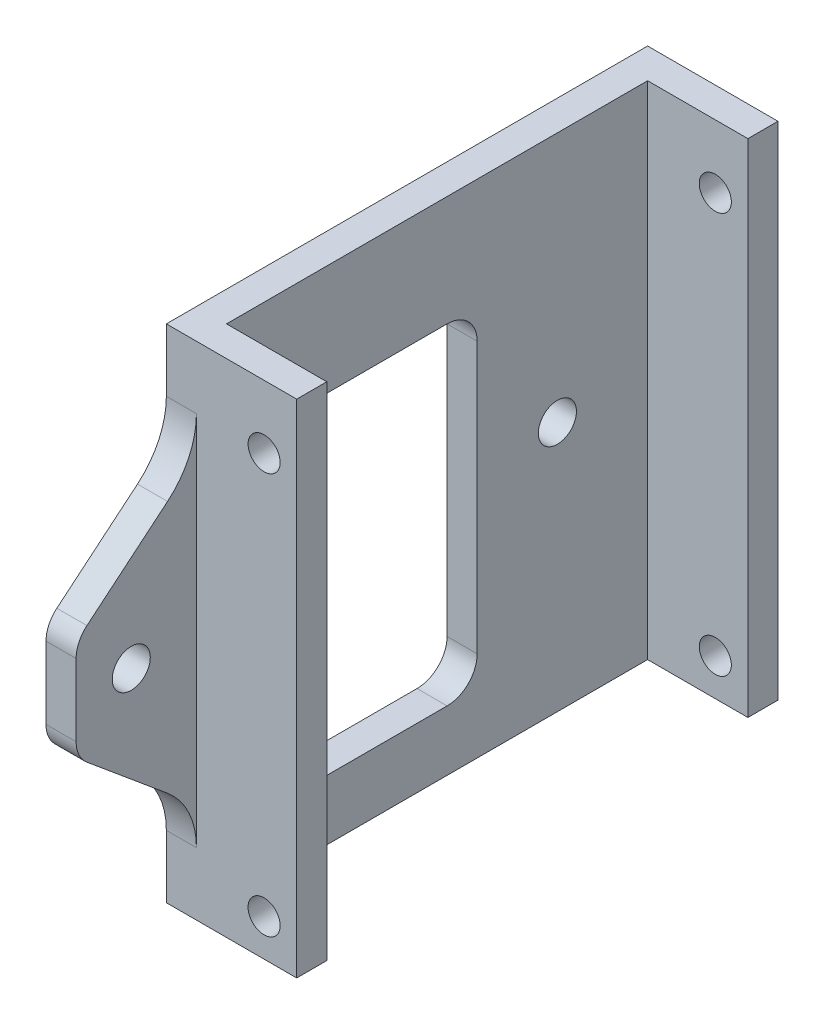
ISO-10303-21;
HEADER;
FILE_DESCRIPTION(('STEP AP214'),'2;1');
FILE_NAME('part.step','',(''),(''),'','','');
FILE_SCHEMA(('AUTOMOTIVE_DESIGN { 1 0 10303 214 1 1 1 1 }'));
ENDSEC;
DATA;
#1=APPLICATION_CONTEXT('core data for automotive mechanical design processes');
#2=APPLICATION_PROTOCOL_DEFINITION('international standard','automotive_design',2000,#1);
#3=PRODUCT_CONTEXT('',#1,'mechanical');
#4=PRODUCT('Part','Part','',(#3));
#5=PRODUCT_RELATED_PRODUCT_CATEGORY('part','',(#4));
#6=PRODUCT_DEFINITION_FORMATION('','',#4);
#7=PRODUCT_DEFINITION_CONTEXT('part definition',#1,'design');
#8=PRODUCT_DEFINITION('design','',#6,#7);
#9=PRODUCT_DEFINITION_SHAPE('','',#8);
#10=(LENGTH_UNIT() NAMED_UNIT(*) SI_UNIT(.MILLI.,.METRE.));
#11=(NAMED_UNIT(*) PLANE_ANGLE_UNIT() SI_UNIT($,.RADIAN.));
#12=(NAMED_UNIT(*) SI_UNIT($,.STERADIAN.) SOLID_ANGLE_UNIT());
#13=UNCERTAINTY_MEASURE_WITH_UNIT(LENGTH_MEASURE(1.E-05),#10,'distance_accuracy_value','');
#14=(GEOMETRIC_REPRESENTATION_CONTEXT(3) GLOBAL_UNCERTAINTY_ASSIGNED_CONTEXT((#13)) GLOBAL_UNIT_ASSIGNED_CONTEXT((#10,
#11,#12)) REPRESENTATION_CONTEXT('',''));
#15=CARTESIAN_POINT('',(0.,0.,0.));
#16=DIRECTION('',(0.,0.,1.));
#17=DIRECTION('',(1.,0.,0.));
#18=AXIS2_PLACEMENT_3D('',#15,#16,#17);
#19=CARTESIAN_POINT('',(0.,50.,12.));
#20=DIRECTION('',(0.,0.,-1.));
#21=DIRECTION('',(-1.,0.,0.));
#22=AXIS2_PLACEMENT_3D('',#19,#20,#21);
#23=PLANE('',#22);
#24=DIRECTION('',(0.,-1.,0.));
#25=VECTOR('',#24,1.);
#26=CARTESIAN_POINT('',(0.,50.,12.));
#27=LINE('',#26,#25);
#28=CARTESIAN_POINT('',(0.,28.5948751620467,12.));
#29=VERTEX_POINT('',#28);
#30=CARTESIAN_POINT('',(0.,21.4051248379533,12.));
#31=VERTEX_POINT('',#30);
#32=EDGE_CURVE('E226',#29,#31,#27,.T.);
#33=ORIENTED_EDGE('',*,*,#32,.T.);
#34=DIRECTION('',(1.,0.,0.));
#35=VECTOR('',#34,1.);
#36=CARTESIAN_POINT('',(0.,21.4051248379533,12.));
#37=LINE('',#36,#35);
#38=CARTESIAN_POINT('',(3.00000000000001,21.4051248379533,12.));
#39=VERTEX_POINT('',#38);
#40=EDGE_CURVE('E237',#31,#39,#37,.T.);
#41=ORIENTED_EDGE('',*,*,#40,.T.);
#42=DIRECTION('',(0.,-1.,0.));
#43=VECTOR('',#42,1.);
#44=CARTESIAN_POINT('',(3.00000000000001,50.,12.));
#45=LINE('',#44,#43);
#46=CARTESIAN_POINT('',(3.00000000000001,28.5948751620467,12.));
#47=VERTEX_POINT('',#46);
#48=EDGE_CURVE('E223',#47,#39,#45,.T.);
#49=ORIENTED_EDGE('',*,*,#48,.F.);
#50=DIRECTION('',(1.,0.,0.));
#51=VECTOR('',#50,1.);
#52=CARTESIAN_POINT('',(0.,28.5948751620467,12.));
#53=LINE('',#52,#51);
#54=EDGE_CURVE('E235',#47,#29,#53,.F.);
#55=ORIENTED_EDGE('',*,*,#54,.T.);
#56=EDGE_LOOP('',(#33,#41,#49,#55));
#57=FACE_BOUND('',#56,.T.);
#58=ADVANCED_FACE('F34',(#57),#23,.F.);
#59=CARTESIAN_POINT('',(3.00000000000001,50.,12.));
#60=DIRECTION('',(-1.,0.,0.));
#61=DIRECTION('',(0.,0.,1.));
#62=AXIS2_PLACEMENT_3D('',#59,#60,#61);
#63=PLANE('',#62);
#64=CARTESIAN_POINT('',(3.00000000000001,25.,6.5));
#65=DIRECTION('',(1.,0.,0.));
#66=DIRECTION('',(0.,0.,-1.));
#67=AXIS2_PLACEMENT_3D('',#64,#65,#66);
#68=CIRCLE('',#67,1.89865);
#69=CARTESIAN_POINT('',(3.00000000000001,25.,4.60135000000001));
#70=VERTEX_POINT('',#69);
#71=EDGE_CURVE('E518',#70,#70,#68,.T.);
#72=ORIENTED_EDGE('',*,*,#71,.F.);
#73=EDGE_LOOP('',(#72));
#74=FACE_BOUND('',#73,.T.);
#75=ORIENTED_EDGE('',*,*,#48,.T.);
#76=CARTESIAN_POINT('',(3.00000000000001,21.4051248379533,9.));
#77=DIRECTION('',(-1.,0.,0.));
#78=DIRECTION('',(0.,0.,1.));
#79=AXIS2_PLACEMENT_3D('',#76,#77,#78);
#80=CIRCLE('',#79,3.);
#81=CARTESIAN_POINT('',(3.00000000000001,19.1004609991612,10.9205531989934));
#82=VERTEX_POINT('',#81);
#83=EDGE_CURVE('E242',#39,#82,#80,.F.);
#84=ORIENTED_EDGE('',*,*,#83,.T.);
#85=DIRECTION('',(0.,0.64018439966448,0.768221279597376));
#86=VECTOR('',#85,1.);
#87=CARTESIAN_POINT('',(3.00000000000001,12.3987706689035,2.87852480268419));
#88=LINE('',#87,#86);
#89=CARTESIAN_POINT('',(3.00000000000001,12.3987706689035,2.8785248026842));
#90=VERTEX_POINT('',#89);
#91=EDGE_CURVE('E216',#90,#82,#88,.T.);
#92=ORIENTED_EDGE('',*,*,#91,.F.);
#93=CARTESIAN_POINT('',(3.00000000000001,6.25300043212446,8.00000000000001));
#94=DIRECTION('',(1.,0.,0.));
#95=DIRECTION('',(0.,0.,-1.));
#96=AXIS2_PLACEMENT_3D('',#93,#94,#95);
#97=CIRCLE('',#96,8.);
#98=CARTESIAN_POINT('',(3.00000000000001,6.25300043212443,0.));
#99=VERTEX_POINT('',#98);
#100=EDGE_CURVE('E198',#99,#90,#97,.T.);
#101=ORIENTED_EDGE('',*,*,#100,.F.);
#102=DIRECTION('',(0.,-1.,0.));
#103=VECTOR('',#102,1.);
#104=CARTESIAN_POINT('',(3.00000000000001,50.,0.));
#105=LINE('',#104,#103);
#106=CARTESIAN_POINT('',(3.00000000000001,43.7469995678756,0.));
#107=VERTEX_POINT('',#106);
#108=EDGE_CURVE('E214',#107,#99,#105,.T.);
#109=ORIENTED_EDGE('',*,*,#108,.F.);
#110=CARTESIAN_POINT('',(3.00000000000001,43.7469995678755,8.));
#111=DIRECTION('',(-1.,0.,0.));
#112=DIRECTION('',(0.,0.,1.));
#113=AXIS2_PLACEMENT_3D('',#110,#111,#112);
#114=CIRCLE('',#113,8.);
#115=CARTESIAN_POINT('',(3.00000000000001,37.6012293310965,2.87852480268419));
#116=VERTEX_POINT('',#115);
#117=EDGE_CURVE('E321',#107,#116,#114,.T.);
#118=ORIENTED_EDGE('',*,*,#117,.T.);
#119=DIRECTION('',(0.,-0.640184399664479,0.768221279597376));
#120=VECTOR('',#119,1.);
#121=CARTESIAN_POINT('',(3.00000000000001,37.6012293310965,2.87852480268419));
#122=LINE('',#121,#120);
#123=CARTESIAN_POINT('',(3.00000000000001,30.8995390008388,10.9205531989934));
#124=VERTEX_POINT('',#123);
#125=EDGE_CURVE('E316',#116,#124,#122,.T.);
#126=ORIENTED_EDGE('',*,*,#125,.T.);
#127=CARTESIAN_POINT('',(3.00000000000001,28.5948751620467,9.));
#128=DIRECTION('',(-1.,0.,0.));
#129=DIRECTION('',(0.,0.,1.));
#130=AXIS2_PLACEMENT_3D('',#127,#128,#129);
#131=CIRCLE('',#130,3.);
#132=EDGE_CURVE('E240',#124,#47,#131,.F.);
#133=ORIENTED_EDGE('',*,*,#132,.T.);
#134=EDGE_LOOP('',(#75,#84,#92,#101,#109,#118,#126,#133));
#135=FACE_BOUND('',#134,.T.);
#136=ADVANCED_FACE('F212',(#74,#135),#63,.F.);
#137=CARTESIAN_POINT('',(3.,50.,-45.));
#138=DIRECTION('',(-1.,0.,0.));
#139=DIRECTION('',(0.,0.,1.));
#140=AXIS2_PLACEMENT_3D('',#137,#138,#139);
#141=PLANE('',#140);
#142=CARTESIAN_POINT('',(3.00000000000001,25.,-36.));
#143=DIRECTION('',(1.,0.,0.));
#144=DIRECTION('',(0.,0.,-1.));
#145=AXIS2_PLACEMENT_3D('',#142,#143,#144);
#146=CIRCLE('',#145,1.89865);
#147=CARTESIAN_POINT('',(3.00000000000001,25.,-37.89865));
#148=VERTEX_POINT('',#147);
#149=EDGE_CURVE('E512',#148,#148,#146,.T.);
#150=ORIENTED_EDGE('',*,*,#149,.F.);
#151=EDGE_LOOP('',(#150));
#152=FACE_BOUND('',#151,.T.);
#153=DIRECTION('',(0.,0.,-1.));
#154=VECTOR('',#153,1.);
#155=CARTESIAN_POINT('',(3.,0.,-45.));
#156=LINE('',#155,#154);
#157=CARTESIAN_POINT('',(3.00000000000001,0.,-3.));
#158=VERTEX_POINT('',#157);
#159=CARTESIAN_POINT('',(3.,0.,-45.));
#160=VERTEX_POINT('',#159);
#161=EDGE_CURVE('E378',#158,#160,#156,.T.);
#162=ORIENTED_EDGE('',*,*,#161,.T.);
#163=DIRECTION('',(0.,-1.,0.));
#164=VECTOR('',#163,1.);
#165=CARTESIAN_POINT('',(3.,50.,-45.));
#166=LINE('',#165,#164);
#167=CARTESIAN_POINT('',(3.,50.,-45.));
#168=VERTEX_POINT('',#167);
#169=EDGE_CURVE('E397',#168,#160,#166,.T.);
#170=ORIENTED_EDGE('',*,*,#169,.F.);
#171=DIRECTION('',(0.,0.,-1.));
#172=VECTOR('',#171,1.);
#173=CARTESIAN_POINT('',(3.,50.,-45.));
#174=LINE('',#173,#172);
#175=CARTESIAN_POINT('',(3.00000000000001,50.,-3.));
#176=VERTEX_POINT('',#175);
#177=EDGE_CURVE('E364',#176,#168,#174,.T.);
#178=ORIENTED_EDGE('',*,*,#177,.F.);
#179=DIRECTION('',(0.,-1.,0.));
#180=VECTOR('',#179,1.);
#181=CARTESIAN_POINT('',(3.00000000000001,50.,-3.));
#182=LINE('',#181,#180);
#183=EDGE_CURVE('E400',#176,#158,#182,.T.);
#184=ORIENTED_EDGE('',*,*,#183,.T.);
#185=EDGE_LOOP('',(#162,#170,#178,#184));
#186=FACE_BOUND('',#185,.T.);
#187=DIRECTION('',(0.,-1.,0.));
#188=VECTOR('',#187,1.);
#189=CARTESIAN_POINT('',(3.00000000000001,39.,-28.));
#190=LINE('',#189,#188);
#191=CARTESIAN_POINT('',(3.00000000000001,36.,-28.));
#192=VERTEX_POINT('',#191);
#193=CARTESIAN_POINT('',(3.00000000000001,9.,-28.));
#194=VERTEX_POINT('',#193);
#195=EDGE_CURVE('E288',#192,#194,#190,.T.);
#196=ORIENTED_EDGE('',*,*,#195,.T.);
#197=CARTESIAN_POINT('',(3.00000000000001,9.,-25.));
#198=DIRECTION('',(-1.,0.,0.));
#199=DIRECTION('',(0.,0.,1.));
#200=AXIS2_PLACEMENT_3D('',#197,#198,#199);
#201=CIRCLE('',#200,3.);
#202=CARTESIAN_POINT('',(3.00000000000001,6.,-25.));
#203=VERTEX_POINT('',#202);
#204=EDGE_CURVE('E276',#194,#203,#201,.T.);
#205=ORIENTED_EDGE('',*,*,#204,.T.);
#206=DIRECTION('',(0.,0.,1.));
#207=VECTOR('',#206,1.);
#208=CARTESIAN_POINT('',(3.00000000000001,6.,-28.));
#209=LINE('',#208,#207);
#210=CARTESIAN_POINT('',(3.00000000000001,6.,-7.6));
#211=VERTEX_POINT('',#210);
#212=EDGE_CURVE('E501',#203,#211,#209,.T.);
#213=ORIENTED_EDGE('',*,*,#212,.T.);
#214=CARTESIAN_POINT('',(3.00000000000001,9.,-7.6));
#215=DIRECTION('',(-1.,0.,0.));
#216=DIRECTION('',(0.,0.,1.));
#217=AXIS2_PLACEMENT_3D('',#214,#215,#216);
#218=CIRCLE('',#217,3.);
#219=CARTESIAN_POINT('',(3.00000000000001,9.,-4.6));
#220=VERTEX_POINT('',#219);
#221=EDGE_CURVE('E272',#211,#220,#218,.T.);
#222=ORIENTED_EDGE('',*,*,#221,.T.);
#223=DIRECTION('',(0.,-1.,0.));
#224=VECTOR('',#223,1.);
#225=CARTESIAN_POINT('',(3.00000000000001,39.,-4.6));
#226=LINE('',#225,#224);
#227=CARTESIAN_POINT('',(3.00000000000001,36.,-4.6));
#228=VERTEX_POINT('',#227);
#229=EDGE_CURVE('E493',#228,#220,#226,.T.);
#230=ORIENTED_EDGE('',*,*,#229,.F.);
#231=CARTESIAN_POINT('',(3.00000000000001,36.,-7.6));
#232=DIRECTION('',(-1.,0.,0.));
#233=DIRECTION('',(0.,0.,1.));
#234=AXIS2_PLACEMENT_3D('',#231,#232,#233);
#235=CIRCLE('',#234,3.);
#236=CARTESIAN_POINT('',(3.00000000000001,39.,-7.6));
#237=VERTEX_POINT('',#236);
#238=EDGE_CURVE('E280',#228,#237,#235,.T.);
#239=ORIENTED_EDGE('',*,*,#238,.T.);
#240=DIRECTION('',(0.,0.,1.));
#241=VECTOR('',#240,1.);
#242=CARTESIAN_POINT('',(3.00000000000001,39.,-28.));
#243=LINE('',#242,#241);
#244=CARTESIAN_POINT('',(3.00000000000001,39.,-25.));
#245=VERTEX_POINT('',#244);
#246=EDGE_CURVE('E289',#245,#237,#243,.T.);
#247=ORIENTED_EDGE('',*,*,#246,.F.);
#248=CARTESIAN_POINT('',(3.00000000000001,36.,-25.));
#249=DIRECTION('',(-1.,0.,0.));
#250=DIRECTION('',(0.,0.,1.));
#251=AXIS2_PLACEMENT_3D('',#248,#249,#250);
#252=CIRCLE('',#251,3.);
#253=EDGE_CURVE('E42',#245,#192,#252,.T.);
#254=ORIENTED_EDGE('',*,*,#253,.T.);
#255=EDGE_LOOP('',(#196,#205,#213,#222,#230,#239,#247,#254));
#256=FACE_BOUND('',#255,.T.);
#257=ADVANCED_FACE('F287',(#152,#186,#256),#141,.F.);
#258=CARTESIAN_POINT('',(0.,50.,0.));
#259=DIRECTION('',(1.,0.,0.));
#260=DIRECTION('',(0.,0.,-1.));
#261=AXIS2_PLACEMENT_3D('',#258,#259,#260);
#262=PLANE('',#261);
#263=CARTESIAN_POINT('',(0.,25.,6.5));
#264=DIRECTION('',(1.,0.,0.));
#265=DIRECTION('',(0.,0.,-1.));
#266=AXIS2_PLACEMENT_3D('',#263,#264,#265);
#267=CIRCLE('',#266,1.89865);
#268=CARTESIAN_POINT('',(0.,25.,4.60135000000001));
#269=VERTEX_POINT('',#268);
#270=EDGE_CURVE('E515',#269,#269,#267,.T.);
#271=ORIENTED_EDGE('',*,*,#270,.T.);
#272=EDGE_LOOP('',(#271));
#273=FACE_BOUND('',#272,.T.);
#274=CARTESIAN_POINT('',(0.,25.,-36.));
#275=DIRECTION('',(1.,0.,0.));
#276=DIRECTION('',(0.,0.,-1.));
#277=AXIS2_PLACEMENT_3D('',#274,#275,#276);
#278=CIRCLE('',#277,1.89865);
#279=CARTESIAN_POINT('',(0.,25.,-37.89865));
#280=VERTEX_POINT('',#279);
#281=EDGE_CURVE('E307',#280,#280,#278,.T.);
#282=ORIENTED_EDGE('',*,*,#281,.T.);
#283=EDGE_LOOP('',(#282));
#284=FACE_BOUND('',#283,.T.);
#285=DIRECTION('',(0.,0.64018439966448,0.768221279597376));
#286=VECTOR('',#285,1.);
#287=CARTESIAN_POINT('',(0.,12.3987706689035,2.87852480268419));
#288=LINE('',#287,#286);
#289=CARTESIAN_POINT('',(0.,12.3987706689035,2.8785248026842));
#290=VERTEX_POINT('',#289);
#291=CARTESIAN_POINT('',(0.,19.1004609991612,10.9205531989934));
#292=VERTEX_POINT('',#291);
#293=EDGE_CURVE('E217',#290,#292,#288,.T.);
#294=ORIENTED_EDGE('',*,*,#293,.T.);
#295=CARTESIAN_POINT('',(0.,21.4051248379533,9.));
#296=DIRECTION('',(1.,0.,0.));
#297=DIRECTION('',(0.,0.,-1.));
#298=AXIS2_PLACEMENT_3D('',#295,#296,#297);
#299=CIRCLE('',#298,3.);
#300=EDGE_CURVE('E248',#292,#31,#299,.F.);
#301=ORIENTED_EDGE('',*,*,#300,.T.);
#302=ORIENTED_EDGE('',*,*,#32,.F.);
#303=CARTESIAN_POINT('',(0.,28.5948751620467,9.));
#304=DIRECTION('',(1.,0.,0.));
#305=DIRECTION('',(0.,0.,-1.));
#306=AXIS2_PLACEMENT_3D('',#303,#304,#305);
#307=CIRCLE('',#306,3.);
#308=CARTESIAN_POINT('',(0.,30.8995390008388,10.9205531989934));
#309=VERTEX_POINT('',#308);
#310=EDGE_CURVE('E246',#29,#309,#307,.F.);
#311=ORIENTED_EDGE('',*,*,#310,.T.);
#312=DIRECTION('',(0.,-0.640184399664479,0.768221279597376));
#313=VECTOR('',#312,1.);
#314=CARTESIAN_POINT('',(0.,37.6012293310965,2.87852480268419));
#315=LINE('',#314,#313);
#316=CARTESIAN_POINT('',(0.,37.6012293310965,2.87852480268419));
#317=VERTEX_POINT('',#316);
#318=EDGE_CURVE('E315',#317,#309,#315,.T.);
#319=ORIENTED_EDGE('',*,*,#318,.F.);
#320=CARTESIAN_POINT('',(0.,43.7469995678755,8.));
#321=DIRECTION('',(-1.,0.,0.));
#322=DIRECTION('',(0.,0.,1.));
#323=AXIS2_PLACEMENT_3D('',#320,#321,#322);
#324=CIRCLE('',#323,8.);
#325=CARTESIAN_POINT('',(0.,43.7469995678756,0.));
#326=VERTEX_POINT('',#325);
#327=EDGE_CURVE('E313',#326,#317,#324,.T.);
#328=ORIENTED_EDGE('',*,*,#327,.F.);
#329=DIRECTION('',(0.,-1.,0.));
#330=VECTOR('',#329,1.);
#331=CARTESIAN_POINT('',(0.,50.,0.));
#332=LINE('',#331,#330);
#333=CARTESIAN_POINT('',(0.,50.,0.));
#334=VERTEX_POINT('',#333);
#335=EDGE_CURVE('E319',#334,#326,#332,.T.);
#336=ORIENTED_EDGE('',*,*,#335,.F.);
#337=DIRECTION('',(0.,0.,1.));
#338=VECTOR('',#337,1.);
#339=CARTESIAN_POINT('',(0.,50.,0.));
#340=LINE('',#339,#338);
#341=CARTESIAN_POINT('',(0.,50.,-48.));
#342=VERTEX_POINT('',#341);
#343=EDGE_CURVE('E354',#342,#334,#340,.T.);
#344=ORIENTED_EDGE('',*,*,#343,.F.);
#345=DIRECTION('',(0.,-1.,0.));
#346=VECTOR('',#345,1.);
#347=CARTESIAN_POINT('',(0.,50.,-48.));
#348=LINE('',#347,#346);
#349=CARTESIAN_POINT('',(0.,0.,-48.));
#350=VERTEX_POINT('',#349);
#351=EDGE_CURVE('E372',#342,#350,#348,.T.);
#352=ORIENTED_EDGE('',*,*,#351,.T.);
#353=DIRECTION('',(0.,0.,1.));
#354=VECTOR('',#353,1.);
#355=CARTESIAN_POINT('',(0.,0.,0.));
#356=LINE('',#355,#354);
#357=CARTESIAN_POINT('',(0.,0.,0.));
#358=VERTEX_POINT('',#357);
#359=EDGE_CURVE('E358',#350,#358,#356,.T.);
#360=ORIENTED_EDGE('',*,*,#359,.T.);
#361=DIRECTION('',(0.,1.,0.));
#362=VECTOR('',#361,1.);
#363=CARTESIAN_POINT('',(0.,0.,0.));
#364=LINE('',#363,#362);
#365=CARTESIAN_POINT('',(0.,6.25300043212443,0.));
#366=VERTEX_POINT('',#365);
#367=EDGE_CURVE('E206',#358,#366,#364,.T.);
#368=ORIENTED_EDGE('',*,*,#367,.T.);
#369=CARTESIAN_POINT('',(0.,6.25300043212446,8.00000000000001));
#370=DIRECTION('',(1.,0.,0.));
#371=DIRECTION('',(0.,0.,-1.));
#372=AXIS2_PLACEMENT_3D('',#369,#370,#371);
#373=CIRCLE('',#372,8.);
#374=EDGE_CURVE('E201',#366,#290,#373,.T.);
#375=ORIENTED_EDGE('',*,*,#374,.T.);
#376=EDGE_LOOP('',(#294,#301,#302,#311,#319,#328,#336,#344,#352,#360,#368,#375));
#377=FACE_BOUND('',#376,.T.);
#378=DIRECTION('',(0.,0.,1.));
#379=VECTOR('',#378,1.);
#380=CARTESIAN_POINT('',(0.,6.,-28.));
#381=LINE('',#380,#379);
#382=CARTESIAN_POINT('',(0.,6.,-25.));
#383=VERTEX_POINT('',#382);
#384=CARTESIAN_POINT('',(0.,6.,-7.6));
#385=VERTEX_POINT('',#384);
#386=EDGE_CURVE('E297',#383,#385,#381,.T.);
#387=ORIENTED_EDGE('',*,*,#386,.F.);
#388=CARTESIAN_POINT('',(0.,9.,-25.));
#389=DIRECTION('',(1.,0.,0.));
#390=DIRECTION('',(0.,0.,-1.));
#391=AXIS2_PLACEMENT_3D('',#388,#389,#390);
#392=CIRCLE('',#391,3.);
#393=CARTESIAN_POINT('',(0.,9.,-28.));
#394=VERTEX_POINT('',#393);
#395=EDGE_CURVE('E278',#383,#394,#392,.T.);
#396=ORIENTED_EDGE('',*,*,#395,.T.);
#397=DIRECTION('',(0.,-1.,0.));
#398=VECTOR('',#397,1.);
#399=CARTESIAN_POINT('',(0.,39.,-28.));
#400=LINE('',#399,#398);
#401=CARTESIAN_POINT('',(0.,36.,-28.));
#402=VERTEX_POINT('',#401);
#403=EDGE_CURVE('E303',#402,#394,#400,.T.);
#404=ORIENTED_EDGE('',*,*,#403,.F.);
#405=CARTESIAN_POINT('',(0.,36.,-25.));
#406=DIRECTION('',(1.,0.,0.));
#407=DIRECTION('',(0.,0.,-1.));
#408=AXIS2_PLACEMENT_3D('',#405,#406,#407);
#409=CIRCLE('',#408,3.);
#410=CARTESIAN_POINT('',(0.,39.,-25.));
#411=VERTEX_POINT('',#410);
#412=EDGE_CURVE('E11',#402,#411,#409,.T.);
#413=ORIENTED_EDGE('',*,*,#412,.T.);
#414=DIRECTION('',(0.,0.,1.));
#415=VECTOR('',#414,1.);
#416=CARTESIAN_POINT('',(0.,39.,-28.));
#417=LINE('',#416,#415);
#418=CARTESIAN_POINT('',(0.,39.,-7.6));
#419=VERTEX_POINT('',#418);
#420=EDGE_CURVE('E300',#411,#419,#417,.T.);
#421=ORIENTED_EDGE('',*,*,#420,.T.);
#422=CARTESIAN_POINT('',(0.,36.,-7.6));
#423=DIRECTION('',(1.,0.,0.));
#424=DIRECTION('',(0.,0.,-1.));
#425=AXIS2_PLACEMENT_3D('',#422,#423,#424);
#426=CIRCLE('',#425,3.);
#427=CARTESIAN_POINT('',(0.,36.,-4.6));
#428=VERTEX_POINT('',#427);
#429=EDGE_CURVE('E282',#419,#428,#426,.T.);
#430=ORIENTED_EDGE('',*,*,#429,.T.);
#431=DIRECTION('',(0.,-1.,0.));
#432=VECTOR('',#431,1.);
#433=CARTESIAN_POINT('',(0.,39.,-4.6));
#434=LINE('',#433,#432);
#435=CARTESIAN_POINT('',(0.,9.,-4.6));
#436=VERTEX_POINT('',#435);
#437=EDGE_CURVE('E302',#428,#436,#434,.T.);
#438=ORIENTED_EDGE('',*,*,#437,.T.);
#439=CARTESIAN_POINT('',(0.,9.,-7.6));
#440=DIRECTION('',(1.,0.,0.));
#441=DIRECTION('',(0.,0.,-1.));
#442=AXIS2_PLACEMENT_3D('',#439,#440,#441);
#443=CIRCLE('',#442,3.);
#444=EDGE_CURVE('E274',#436,#385,#443,.T.);
#445=ORIENTED_EDGE('',*,*,#444,.T.);
#446=EDGE_LOOP('',(#387,#396,#404,#413,#421,#430,#438,#445));
#447=FACE_BOUND('',#446,.T.);
#448=ADVANCED_FACE('F434',(#273,#284,#377,#447),#262,.F.);
#449=CARTESIAN_POINT('',(0.,50.,0.));
#450=DIRECTION('',(0.,1.,0.));
#451=DIRECTION('',(0.,0.,1.));
#452=AXIS2_PLACEMENT_3D('',#449,#450,#451);
#453=PLANE('',#452);
#454=ORIENTED_EDGE('',*,*,#343,.T.);
#455=DIRECTION('',(1.,0.,0.));
#456=VECTOR('',#455,1.);
#457=CARTESIAN_POINT('',(3.00000000000001,50.,0.));
#458=LINE('',#457,#456);
#459=CARTESIAN_POINT('',(13.,50.,0.));
#460=VERTEX_POINT('',#459);
#461=EDGE_CURVE('E357',#334,#460,#458,.T.);
#462=ORIENTED_EDGE('',*,*,#461,.T.);
#463=DIRECTION('',(0.,0.,-1.));
#464=VECTOR('',#463,1.);
#465=CARTESIAN_POINT('',(13.,50.,-3.00000000000001));
#466=LINE('',#465,#464);
#467=CARTESIAN_POINT('',(13.,50.,-3.00000000000001));
#468=VERTEX_POINT('',#467);
#469=EDGE_CURVE('E360',#460,#468,#466,.T.);
#470=ORIENTED_EDGE('',*,*,#469,.T.);
#471=DIRECTION('',(-1.,0.,0.));
#472=VECTOR('',#471,1.);
#473=CARTESIAN_POINT('',(3.00000000000001,50.,-3.));
#474=LINE('',#473,#472);
#475=EDGE_CURVE('E362',#468,#176,#474,.T.);
#476=ORIENTED_EDGE('',*,*,#475,.T.);
#477=ORIENTED_EDGE('',*,*,#177,.T.);
#478=DIRECTION('',(1.,0.,0.));
#479=VECTOR('',#478,1.);
#480=CARTESIAN_POINT('',(13.,50.,-45.));
#481=LINE('',#480,#479);
#482=CARTESIAN_POINT('',(13.,50.,-45.));
#483=VERTEX_POINT('',#482);
#484=EDGE_CURVE('E366',#168,#483,#481,.T.);
#485=ORIENTED_EDGE('',*,*,#484,.T.);
#486=DIRECTION('',(0.,0.,-1.));
#487=VECTOR('',#486,1.);
#488=CARTESIAN_POINT('',(13.,50.,-48.));
#489=LINE('',#488,#487);
#490=CARTESIAN_POINT('',(13.,50.,-48.));
#491=VERTEX_POINT('',#490);
#492=EDGE_CURVE('E368',#483,#491,#489,.T.);
#493=ORIENTED_EDGE('',*,*,#492,.T.);
#494=DIRECTION('',(-1.,0.,0.));
#495=VECTOR('',#494,1.);
#496=CARTESIAN_POINT('',(3.,50.,-48.));
#497=LINE('',#496,#495);
#498=EDGE_CURVE('E370',#491,#342,#497,.T.);
#499=ORIENTED_EDGE('',*,*,#498,.T.);
#500=EDGE_LOOP('',(#454,#462,#470,#476,#477,#485,#493,#499));
#501=FACE_BOUND('',#500,.T.);
#502=ADVANCED_FACE('F426',(#501),#453,.T.);
#503=CARTESIAN_POINT('',(3.00000000000001,50.,0.));
#504=DIRECTION('',(0.,0.,-1.));
#505=DIRECTION('',(-1.,0.,0.));
#506=AXIS2_PLACEMENT_3D('',#503,#504,#505);
#507=PLANE('',#506);
#508=CARTESIAN_POINT('',(9.75000000000001,43.7,0.));
#509=DIRECTION('',(0.,0.,1.));
#510=DIRECTION('',(1.,0.,0.));
#511=AXIS2_PLACEMENT_3D('',#508,#509,#510);
#512=CIRCLE('',#511,1.6);
#513=CARTESIAN_POINT('',(11.35,43.7,0.));
#514=VERTEX_POINT('',#513);
#515=EDGE_CURVE('E334',#514,#514,#512,.T.);
#516=ORIENTED_EDGE('',*,*,#515,.F.);
#517=EDGE_LOOP('',(#516));
#518=FACE_BOUND('',#517,.T.);
#519=CARTESIAN_POINT('',(9.75000000000001,3.7,0.));
#520=DIRECTION('',(0.,0.,1.));
#521=DIRECTION('',(1.,0.,0.));
#522=AXIS2_PLACEMENT_3D('',#519,#520,#521);
#523=CIRCLE('',#522,1.6);
#524=CARTESIAN_POINT('',(11.35,3.7,0.));
#525=VERTEX_POINT('',#524);
#526=EDGE_CURVE('E329',#525,#525,#523,.T.);
#527=ORIENTED_EDGE('',*,*,#526,.F.);
#528=EDGE_LOOP('',(#527));
#529=FACE_BOUND('',#528,.T.);
#530=DIRECTION('',(1.,0.,0.));
#531=VECTOR('',#530,1.);
#532=CARTESIAN_POINT('',(3.00000000000001,0.,0.));
#533=LINE('',#532,#531);
#534=CARTESIAN_POINT('',(13.,0.,0.));
#535=VERTEX_POINT('',#534);
#536=EDGE_CURVE('E353',#358,#535,#533,.T.);
#537=ORIENTED_EDGE('',*,*,#536,.T.);
#538=DIRECTION('',(0.,-1.,0.));
#539=VECTOR('',#538,1.);
#540=CARTESIAN_POINT('',(13.,50.,0.));
#541=LINE('',#540,#539);
#542=EDGE_CURVE('E224',#460,#535,#541,.T.);
#543=ORIENTED_EDGE('',*,*,#542,.F.);
#544=ORIENTED_EDGE('',*,*,#461,.F.);
#545=ORIENTED_EDGE('',*,*,#335,.T.);
#546=DIRECTION('',(1.,0.,0.));
#547=VECTOR('',#546,1.);
#548=CARTESIAN_POINT('',(0.,43.7469995678756,0.));
#549=LINE('',#548,#547);
#550=EDGE_CURVE('E221',#326,#107,#549,.T.);
#551=ORIENTED_EDGE('',*,*,#550,.T.);
#552=ORIENTED_EDGE('',*,*,#108,.T.);
#553=DIRECTION('',(1.,0.,0.));
#554=VECTOR('',#553,1.);
#555=CARTESIAN_POINT('',(0.,6.25300043212443,0.));
#556=LINE('',#555,#554);
#557=EDGE_CURVE('E195',#366,#99,#556,.T.);
#558=ORIENTED_EDGE('',*,*,#557,.F.);
#559=ORIENTED_EDGE('',*,*,#367,.F.);
#560=EDGE_LOOP('',(#537,#543,#544,#545,#551,#552,#558,#559));
#561=FACE_BOUND('',#560,.T.);
#562=ADVANCED_FACE('F219',(#518,#529,#561),#507,.F.);
#563=CARTESIAN_POINT('',(13.,50.,-3.00000000000001));
#564=DIRECTION('',(-1.,0.,0.));
#565=DIRECTION('',(0.,0.,1.));
#566=AXIS2_PLACEMENT_3D('',#563,#564,#565);
#567=PLANE('',#566);
#568=DIRECTION('',(0.,0.,-1.));
#569=VECTOR('',#568,1.);
#570=CARTESIAN_POINT('',(13.,0.,-3.00000000000001));
#571=LINE('',#570,#569);
#572=CARTESIAN_POINT('',(13.,0.,-3.00000000000001));
#573=VERTEX_POINT('',#572);
#574=EDGE_CURVE('E374',#535,#573,#571,.T.);
#575=ORIENTED_EDGE('',*,*,#574,.T.);
#576=DIRECTION('',(0.,-1.,0.));
#577=VECTOR('',#576,1.);
#578=CARTESIAN_POINT('',(13.,50.,-3.00000000000001));
#579=LINE('',#578,#577);
#580=EDGE_CURVE('E229',#468,#573,#579,.T.);
#581=ORIENTED_EDGE('',*,*,#580,.F.);
#582=ORIENTED_EDGE('',*,*,#469,.F.);
#583=ORIENTED_EDGE('',*,*,#542,.T.);
#584=EDGE_LOOP('',(#575,#581,#582,#583));
#585=FACE_BOUND('',#584,.T.);
#586=ADVANCED_FACE('F429',(#585),#567,.F.);
#587=CARTESIAN_POINT('',(3.00000000000001,50.,-3.));
#588=DIRECTION('',(0.,0.,1.));
#589=DIRECTION('',(1.,0.,0.));
#590=AXIS2_PLACEMENT_3D('',#587,#588,#589);
#591=PLANE('',#590);
#592=CARTESIAN_POINT('',(9.75000000000001,43.7,-3.00000000000001));
#593=DIRECTION('',(0.,0.,1.));
#594=DIRECTION('',(1.,0.,0.));
#595=AXIS2_PLACEMENT_3D('',#592,#593,#594);
#596=CIRCLE('',#595,1.6);
#597=CARTESIAN_POINT('',(11.35,43.7,-3.00000000000001));
#598=VERTEX_POINT('',#597);
#599=EDGE_CURVE('E350',#598,#598,#596,.T.);
#600=ORIENTED_EDGE('',*,*,#599,.T.);
#601=EDGE_LOOP('',(#600));
#602=FACE_BOUND('',#601,.T.);
#603=CARTESIAN_POINT('',(9.75000000000001,3.7,-3.00000000000001));
#604=DIRECTION('',(0.,0.,1.));
#605=DIRECTION('',(1.,0.,0.));
#606=AXIS2_PLACEMENT_3D('',#603,#604,#605);
#607=CIRCLE('',#606,1.6);
#608=CARTESIAN_POINT('',(11.35,3.7,-3.00000000000001));
#609=VERTEX_POINT('',#608);
#610=EDGE_CURVE('E344',#609,#609,#607,.T.);
#611=ORIENTED_EDGE('',*,*,#610,.T.);
#612=EDGE_LOOP('',(#611));
#613=FACE_BOUND('',#612,.T.);
#614=DIRECTION('',(-1.,0.,0.));
#615=VECTOR('',#614,1.);
#616=CARTESIAN_POINT('',(3.00000000000001,0.,-3.));
#617=LINE('',#616,#615);
#618=EDGE_CURVE('E376',#573,#158,#617,.T.);
#619=ORIENTED_EDGE('',*,*,#618,.T.);
#620=ORIENTED_EDGE('',*,*,#183,.F.);
#621=ORIENTED_EDGE('',*,*,#475,.F.);
#622=ORIENTED_EDGE('',*,*,#580,.T.);
#623=EDGE_LOOP('',(#619,#620,#621,#622));
#624=FACE_BOUND('',#623,.T.);
#625=ADVANCED_FACE('F407',(#602,#613,#624),#591,.F.);
#626=CARTESIAN_POINT('',(13.,50.,-45.));
#627=DIRECTION('',(0.,0.,-1.));
#628=DIRECTION('',(-1.,0.,0.));
#629=AXIS2_PLACEMENT_3D('',#626,#627,#628);
#630=PLANE('',#629);
#631=CARTESIAN_POINT('',(9.75000000000001,43.7,-45.));
#632=DIRECTION('',(0.,0.,-1.));
#633=DIRECTION('',(-1.,0.,0.));
#634=AXIS2_PLACEMENT_3D('',#631,#632,#633);
#635=CIRCLE('',#634,1.6);
#636=CARTESIAN_POINT('',(8.15,43.7,-45.));
#637=VERTEX_POINT('',#636);
#638=EDGE_CURVE('E347',#637,#637,#635,.T.);
#639=ORIENTED_EDGE('',*,*,#638,.T.);
#640=EDGE_LOOP('',(#639));
#641=FACE_BOUND('',#640,.T.);
#642=CARTESIAN_POINT('',(9.75000000000001,3.7,-45.));
#643=DIRECTION('',(0.,0.,-1.));
#644=DIRECTION('',(-1.,0.,0.));
#645=AXIS2_PLACEMENT_3D('',#642,#643,#644);
#646=CIRCLE('',#645,1.6);
#647=CARTESIAN_POINT('',(8.15,3.7,-45.));
#648=VERTEX_POINT('',#647);
#649=EDGE_CURVE('E333',#648,#648,#646,.T.);
#650=ORIENTED_EDGE('',*,*,#649,.T.);
#651=EDGE_LOOP('',(#650));
#652=FACE_BOUND('',#651,.T.);
#653=DIRECTION('',(1.,0.,0.));
#654=VECTOR('',#653,1.);
#655=CARTESIAN_POINT('',(13.,0.,-45.));
#656=LINE('',#655,#654);
#657=CARTESIAN_POINT('',(13.,0.,-45.));
#658=VERTEX_POINT('',#657);
#659=EDGE_CURVE('E380',#160,#658,#656,.T.);
#660=ORIENTED_EDGE('',*,*,#659,.T.);
#661=DIRECTION('',(0.,-1.,0.));
#662=VECTOR('',#661,1.);
#663=CARTESIAN_POINT('',(13.,50.,-45.));
#664=LINE('',#663,#662);
#665=EDGE_CURVE('E394',#483,#658,#664,.T.);
#666=ORIENTED_EDGE('',*,*,#665,.F.);
#667=ORIENTED_EDGE('',*,*,#484,.F.);
#668=ORIENTED_EDGE('',*,*,#169,.T.);
#669=EDGE_LOOP('',(#660,#666,#667,#668));
#670=FACE_BOUND('',#669,.T.);
#671=ADVANCED_FACE('F422',(#641,#652,#670),#630,.F.);
#672=CARTESIAN_POINT('',(13.,50.,-48.));
#673=DIRECTION('',(-1.,0.,0.));
#674=DIRECTION('',(0.,0.,1.));
#675=AXIS2_PLACEMENT_3D('',#672,#673,#674);
#676=PLANE('',#675);
#677=DIRECTION('',(0.,0.,-1.));
#678=VECTOR('',#677,1.);
#679=CARTESIAN_POINT('',(13.,0.,-48.));
#680=LINE('',#679,#678);
#681=CARTESIAN_POINT('',(13.,0.,-48.));
#682=VERTEX_POINT('',#681);
#683=EDGE_CURVE('E382',#658,#682,#680,.T.);
#684=ORIENTED_EDGE('',*,*,#683,.T.);
#685=DIRECTION('',(0.,-1.,0.));
#686=VECTOR('',#685,1.);
#687=CARTESIAN_POINT('',(13.,50.,-48.));
#688=LINE('',#687,#686);
#689=EDGE_CURVE('E391',#491,#682,#688,.T.);
#690=ORIENTED_EDGE('',*,*,#689,.F.);
#691=ORIENTED_EDGE('',*,*,#492,.F.);
#692=ORIENTED_EDGE('',*,*,#665,.T.);
#693=EDGE_LOOP('',(#684,#690,#691,#692));
#694=FACE_BOUND('',#693,.T.);
#695=ADVANCED_FACE('F441',(#694),#676,.F.);
#696=CARTESIAN_POINT('',(0.,50.,-48.));
#697=DIRECTION('',(0.,0.,1.));
#698=DIRECTION('',(1.,0.,0.));
#699=AXIS2_PLACEMENT_3D('',#696,#697,#698);
#700=PLANE('',#699);
#701=CARTESIAN_POINT('',(9.75000000000001,43.7,-48.));
#702=DIRECTION('',(0.,0.,1.));
#703=DIRECTION('',(1.,0.,0.));
#704=AXIS2_PLACEMENT_3D('',#701,#702,#703);
#705=CIRCLE('',#704,1.6);
#706=CARTESIAN_POINT('',(11.35,43.7,-48.));
#707=VERTEX_POINT('',#706);
#708=EDGE_CURVE('E330',#707,#707,#705,.T.);
#709=ORIENTED_EDGE('',*,*,#708,.T.);
#710=EDGE_LOOP('',(#709));
#711=FACE_BOUND('',#710,.T.);
#712=CARTESIAN_POINT('',(9.75000000000001,3.7,-48.));
#713=DIRECTION('',(0.,0.,1.));
#714=DIRECTION('',(1.,0.,0.));
#715=AXIS2_PLACEMENT_3D('',#712,#713,#714);
#716=CIRCLE('',#715,1.6);
#717=CARTESIAN_POINT('',(11.35,3.7,-48.));
#718=VERTEX_POINT('',#717);
#719=EDGE_CURVE('E337',#718,#718,#716,.T.);
#720=ORIENTED_EDGE('',*,*,#719,.T.);
#721=EDGE_LOOP('',(#720));
#722=FACE_BOUND('',#721,.T.);
#723=DIRECTION('',(-1.,0.,0.));
#724=VECTOR('',#723,1.);
#725=CARTESIAN_POINT('',(0.,0.,-48.));
#726=LINE('',#725,#724);
#727=EDGE_CURVE('E385',#682,#350,#726,.T.);
#728=ORIENTED_EDGE('',*,*,#727,.T.);
#729=ORIENTED_EDGE('',*,*,#351,.F.);
#730=ORIENTED_EDGE('',*,*,#498,.F.);
#731=ORIENTED_EDGE('',*,*,#689,.T.);
#732=EDGE_LOOP('',(#728,#729,#730,#731));
#733=FACE_BOUND('',#732,.T.);
#734=ADVANCED_FACE('F439',(#711,#722,#733),#700,.F.);
#735=CARTESIAN_POINT('',(0.,0.,0.));
#736=DIRECTION('',(0.,1.,0.));
#737=DIRECTION('',(0.,0.,1.));
#738=AXIS2_PLACEMENT_3D('',#735,#736,#737);
#739=PLANE('',#738);
#740=ORIENTED_EDGE('',*,*,#536,.F.);
#741=ORIENTED_EDGE('',*,*,#359,.F.);
#742=ORIENTED_EDGE('',*,*,#727,.F.);
#743=ORIENTED_EDGE('',*,*,#683,.F.);
#744=ORIENTED_EDGE('',*,*,#659,.F.);
#745=ORIENTED_EDGE('',*,*,#161,.F.);
#746=ORIENTED_EDGE('',*,*,#618,.F.);
#747=ORIENTED_EDGE('',*,*,#574,.F.);
#748=EDGE_LOOP('',(#740,#741,#742,#743,#744,#745,#746,#747));
#749=FACE_BOUND('',#748,.T.);
#750=ADVANCED_FACE('F414',(#749),#739,.F.);
#751=CARTESIAN_POINT('',(9.75000000000001,3.7,-48.));
#752=DIRECTION('',(0.,0.,1.));
#753=DIRECTION('',(1.,0.,0.));
#754=AXIS2_PLACEMENT_3D('',#751,#752,#753);
#755=CYLINDRICAL_SURFACE('',#754,1.6);
#756=ORIENTED_EDGE('',*,*,#719,.F.);
#757=EDGE_LOOP('',(#756));
#758=FACE_BOUND('',#757,.T.);
#759=ORIENTED_EDGE('',*,*,#649,.F.);
#760=EDGE_LOOP('',(#759));
#761=FACE_BOUND('',#760,.T.);
#762=ADVANCED_FACE('F564',(#758,#761),#755,.F.);
#763=CARTESIAN_POINT('',(9.75000000000001,43.7,-48.));
#764=DIRECTION('',(0.,0.,1.));
#765=DIRECTION('',(1.,0.,0.));
#766=AXIS2_PLACEMENT_3D('',#763,#764,#765);
#767=CYLINDRICAL_SURFACE('',#766,1.6);
#768=ORIENTED_EDGE('',*,*,#708,.F.);
#769=EDGE_LOOP('',(#768));
#770=FACE_BOUND('',#769,.T.);
#771=ORIENTED_EDGE('',*,*,#638,.F.);
#772=EDGE_LOOP('',(#771));
#773=FACE_BOUND('',#772,.T.);
#774=ADVANCED_FACE('F560',(#770,#773),#767,.F.);
#775=ORIENTED_EDGE('',*,*,#526,.T.);
#776=EDGE_LOOP('',(#775));
#777=FACE_BOUND('',#776,.T.);
#778=ORIENTED_EDGE('',*,*,#610,.F.);
#779=EDGE_LOOP('',(#778));
#780=FACE_BOUND('',#779,.T.);
#781=ADVANCED_FACE('F558',(#777,#780),#755,.F.);
#782=ORIENTED_EDGE('',*,*,#515,.T.);
#783=EDGE_LOOP('',(#782));
#784=FACE_BOUND('',#783,.T.);
#785=ORIENTED_EDGE('',*,*,#599,.F.);
#786=EDGE_LOOP('',(#785));
#787=FACE_BOUND('',#786,.T.);
#788=ADVANCED_FACE('F536',(#784,#787),#767,.F.);
#789=CARTESIAN_POINT('',(0.,12.3987706689035,2.87852480268419));
#790=DIRECTION('',(0.,0.768221279597376,-0.64018439966448));
#791=DIRECTION('',(0.,0.64018439966448,0.768221279597376));
#792=AXIS2_PLACEMENT_3D('',#789,#790,#791);
#793=PLANE('',#792);
#794=ORIENTED_EDGE('',*,*,#91,.T.);
#795=DIRECTION('',(1.,0.,0.));
#796=VECTOR('',#795,1.);
#797=CARTESIAN_POINT('',(0.,19.1004609991612,10.9205531989934));
#798=LINE('',#797,#796);
#799=EDGE_CURVE('E244',#82,#292,#798,.F.);
#800=ORIENTED_EDGE('',*,*,#799,.T.);
#801=ORIENTED_EDGE('',*,*,#293,.F.);
#802=DIRECTION('',(1.,0.,0.));
#803=VECTOR('',#802,1.);
#804=CARTESIAN_POINT('',(0.,12.3987706689035,2.8785248026842));
#805=LINE('',#804,#803);
#806=EDGE_CURVE('E207',#290,#90,#805,.T.);
#807=ORIENTED_EDGE('',*,*,#806,.T.);
#808=EDGE_LOOP('',(#794,#800,#801,#807));
#809=FACE_BOUND('',#808,.T.);
#810=ADVANCED_FACE('F533',(#809),#793,.F.);
#811=CARTESIAN_POINT('',(0.,6.25300043212446,8.00000000000001));
#812=DIRECTION('',(1.,0.,0.));
#813=DIRECTION('',(0.,0.,-1.));
#814=AXIS2_PLACEMENT_3D('',#811,#812,#813);
#815=CYLINDRICAL_SURFACE('',#814,8.);
#816=ORIENTED_EDGE('',*,*,#100,.T.);
#817=ORIENTED_EDGE('',*,*,#806,.F.);
#818=ORIENTED_EDGE('',*,*,#374,.F.);
#819=ORIENTED_EDGE('',*,*,#557,.T.);
#820=EDGE_LOOP('',(#816,#817,#818,#819));
#821=FACE_BOUND('',#820,.T.);
#822=ADVANCED_FACE('F197',(#821),#815,.F.);
#823=CARTESIAN_POINT('',(0.,43.7469995678755,8.));
#824=DIRECTION('',(1.,0.,0.));
#825=DIRECTION('',(0.,0.,-1.));
#826=AXIS2_PLACEMENT_3D('',#823,#824,#825);
#827=CYLINDRICAL_SURFACE('',#826,8.);
#828=ORIENTED_EDGE('',*,*,#117,.F.);
#829=ORIENTED_EDGE('',*,*,#550,.F.);
#830=ORIENTED_EDGE('',*,*,#327,.T.);
#831=DIRECTION('',(1.,0.,0.));
#832=VECTOR('',#831,1.);
#833=CARTESIAN_POINT('',(0.,37.6012293310965,2.87852480268419));
#834=LINE('',#833,#832);
#835=EDGE_CURVE('E326',#317,#116,#834,.T.);
#836=ORIENTED_EDGE('',*,*,#835,.T.);
#837=EDGE_LOOP('',(#828,#829,#830,#836));
#838=FACE_BOUND('',#837,.T.);
#839=ADVANCED_FACE('F540',(#838),#827,.F.);
#840=CARTESIAN_POINT('',(0.,37.6012293310965,2.87852480268419));
#841=DIRECTION('',(0.,0.768221279597376,0.640184399664479));
#842=DIRECTION('',(0.,-0.640184399664479,0.768221279597376));
#843=AXIS2_PLACEMENT_3D('',#840,#841,#842);
#844=PLANE('',#843);
#845=ORIENTED_EDGE('',*,*,#318,.T.);
#846=DIRECTION('',(1.,0.,0.));
#847=VECTOR('',#846,1.);
#848=CARTESIAN_POINT('',(3.00000000000001,30.8995390008388,10.9205531989934));
#849=LINE('',#848,#847);
#850=EDGE_CURVE('E250',#309,#124,#849,.T.);
#851=ORIENTED_EDGE('',*,*,#850,.T.);
#852=ORIENTED_EDGE('',*,*,#125,.F.);
#853=ORIENTED_EDGE('',*,*,#835,.F.);
#854=EDGE_LOOP('',(#845,#851,#852,#853));
#855=FACE_BOUND('',#854,.T.);
#856=ADVANCED_FACE('F543',(#855),#844,.T.);
#857=CARTESIAN_POINT('',(0.,6.,-28.));
#858=DIRECTION('',(0.,1.,0.));
#859=DIRECTION('',(0.,0.,1.));
#860=AXIS2_PLACEMENT_3D('',#857,#858,#859);
#861=PLANE('',#860);
#862=ORIENTED_EDGE('',*,*,#386,.T.);
#863=DIRECTION('',(1.,0.,0.));
#864=VECTOR('',#863,1.);
#865=CARTESIAN_POINT('',(0.,6.,-7.6));
#866=LINE('',#865,#864);
#867=EDGE_CURVE('E255',#385,#211,#866,.T.);
#868=ORIENTED_EDGE('',*,*,#867,.T.);
#869=ORIENTED_EDGE('',*,*,#212,.F.);
#870=DIRECTION('',(1.,0.,0.));
#871=VECTOR('',#870,1.);
#872=CARTESIAN_POINT('',(0.,6.,-25.));
#873=LINE('',#872,#871);
#874=EDGE_CURVE('E253',#203,#383,#873,.F.);
#875=ORIENTED_EDGE('',*,*,#874,.T.);
#876=EDGE_LOOP('',(#862,#868,#869,#875));
#877=FACE_BOUND('',#876,.T.);
#878=ADVANCED_FACE('F497',(#877),#861,.T.);
#879=CARTESIAN_POINT('',(0.,39.,-4.6));
#880=DIRECTION('',(0.,0.,1.));
#881=DIRECTION('',(1.,0.,0.));
#882=AXIS2_PLACEMENT_3D('',#879,#880,#881);
#883=PLANE('',#882);
#884=ORIENTED_EDGE('',*,*,#229,.T.);
#885=DIRECTION('',(1.,0.,0.));
#886=VECTOR('',#885,1.);
#887=CARTESIAN_POINT('',(0.,9.,-4.6));
#888=LINE('',#887,#886);
#889=EDGE_CURVE('E261',#220,#436,#888,.F.);
#890=ORIENTED_EDGE('',*,*,#889,.T.);
#891=ORIENTED_EDGE('',*,*,#437,.F.);
#892=DIRECTION('',(1.,0.,0.));
#893=VECTOR('',#892,1.);
#894=CARTESIAN_POINT('',(3.00000000000001,36.,-4.6));
#895=LINE('',#894,#893);
#896=EDGE_CURVE('E258',#428,#228,#895,.T.);
#897=ORIENTED_EDGE('',*,*,#896,.T.);
#898=EDGE_LOOP('',(#884,#890,#891,#897));
#899=FACE_BOUND('',#898,.T.);
#900=ADVANCED_FACE('F490',(#899),#883,.F.);
#901=CARTESIAN_POINT('',(0.,39.,-28.));
#902=DIRECTION('',(0.,1.,0.));
#903=DIRECTION('',(0.,0.,1.));
#904=AXIS2_PLACEMENT_3D('',#901,#902,#903);
#905=PLANE('',#904);
#906=ORIENTED_EDGE('',*,*,#246,.T.);
#907=DIRECTION('',(1.,0.,0.));
#908=VECTOR('',#907,1.);
#909=CARTESIAN_POINT('',(0.,39.,-7.6));
#910=LINE('',#909,#908);
#911=EDGE_CURVE('E49',#237,#419,#910,.F.);
#912=ORIENTED_EDGE('',*,*,#911,.T.);
#913=ORIENTED_EDGE('',*,*,#420,.F.);
#914=DIRECTION('',(1.,0.,0.));
#915=VECTOR('',#914,1.);
#916=CARTESIAN_POINT('',(0.,39.,-25.));
#917=LINE('',#916,#915);
#918=EDGE_CURVE('E268',#411,#245,#917,.T.);
#919=ORIENTED_EDGE('',*,*,#918,.T.);
#920=EDGE_LOOP('',(#906,#912,#913,#919));
#921=FACE_BOUND('',#920,.T.);
#922=ADVANCED_FACE('F299',(#921),#905,.F.);
#923=CARTESIAN_POINT('',(0.,39.,-28.));
#924=DIRECTION('',(0.,0.,1.));
#925=DIRECTION('',(0.,-1.,0.));
#926=AXIS2_PLACEMENT_3D('',#923,#924,#925);
#927=PLANE('',#926);
#928=ORIENTED_EDGE('',*,*,#403,.T.);
#929=DIRECTION('',(1.,0.,0.));
#930=VECTOR('',#929,1.);
#931=CARTESIAN_POINT('',(3.00000000000001,9.,-28.));
#932=LINE('',#931,#930);
#933=EDGE_CURVE('E265',#394,#194,#932,.T.);
#934=ORIENTED_EDGE('',*,*,#933,.T.);
#935=ORIENTED_EDGE('',*,*,#195,.F.);
#936=DIRECTION('',(1.,0.,0.));
#937=VECTOR('',#936,1.);
#938=CARTESIAN_POINT('',(0.,36.,-28.));
#939=LINE('',#938,#937);
#940=EDGE_CURVE('E263',#192,#402,#939,.F.);
#941=ORIENTED_EDGE('',*,*,#940,.T.);
#942=EDGE_LOOP('',(#928,#934,#935,#941));
#943=FACE_BOUND('',#942,.T.);
#944=ADVANCED_FACE('F295',(#943),#927,.T.);
#945=CARTESIAN_POINT('',(0.,21.4051248379533,9.));
#946=DIRECTION('',(1.,0.,0.));
#947=DIRECTION('',(0.,1.,0.));
#948=AXIS2_PLACEMENT_3D('',#945,#946,#947);
#949=CYLINDRICAL_SURFACE('',#948,3.);
#950=ORIENTED_EDGE('',*,*,#300,.F.);
#951=ORIENTED_EDGE('',*,*,#799,.F.);
#952=ORIENTED_EDGE('',*,*,#83,.F.);
#953=ORIENTED_EDGE('',*,*,#40,.F.);
#954=EDGE_LOOP('',(#950,#951,#952,#953));
#955=FACE_BOUND('',#954,.T.);
#956=ADVANCED_FACE('F462',(#955),#949,.T.);
#957=CARTESIAN_POINT('',(0.,28.5948751620467,9.));
#958=DIRECTION('',(-1.,0.,0.));
#959=DIRECTION('',(0.,-1.,0.));
#960=AXIS2_PLACEMENT_3D('',#957,#958,#959);
#961=CYLINDRICAL_SURFACE('',#960,3.);
#962=ORIENTED_EDGE('',*,*,#310,.F.);
#963=ORIENTED_EDGE('',*,*,#54,.F.);
#964=ORIENTED_EDGE('',*,*,#132,.F.);
#965=ORIENTED_EDGE('',*,*,#850,.F.);
#966=EDGE_LOOP('',(#962,#963,#964,#965));
#967=FACE_BOUND('',#966,.T.);
#968=ADVANCED_FACE('F465',(#967),#961,.T.);
#969=CARTESIAN_POINT('',(0.,9.,-7.6));
#970=DIRECTION('',(1.,0.,0.));
#971=DIRECTION('',(0.,0.,-1.));
#972=AXIS2_PLACEMENT_3D('',#969,#970,#971);
#973=CYLINDRICAL_SURFACE('',#972,3.);
#974=ORIENTED_EDGE('',*,*,#444,.F.);
#975=ORIENTED_EDGE('',*,*,#889,.F.);
#976=ORIENTED_EDGE('',*,*,#221,.F.);
#977=ORIENTED_EDGE('',*,*,#867,.F.);
#978=EDGE_LOOP('',(#974,#975,#976,#977));
#979=FACE_BOUND('',#978,.T.);
#980=ADVANCED_FACE('F469',(#979),#973,.F.);
#981=CARTESIAN_POINT('',(0.,9.,-25.));
#982=DIRECTION('',(-1.,0.,0.));
#983=DIRECTION('',(0.,0.,1.));
#984=AXIS2_PLACEMENT_3D('',#981,#982,#983);
#985=CYLINDRICAL_SURFACE('',#984,3.);
#986=ORIENTED_EDGE('',*,*,#395,.F.);
#987=ORIENTED_EDGE('',*,*,#874,.F.);
#988=ORIENTED_EDGE('',*,*,#204,.F.);
#989=ORIENTED_EDGE('',*,*,#933,.F.);
#990=EDGE_LOOP('',(#986,#987,#988,#989));
#991=FACE_BOUND('',#990,.T.);
#992=ADVANCED_FACE('F473',(#991),#985,.F.);
#993=CARTESIAN_POINT('',(0.,36.,-7.6));
#994=DIRECTION('',(-1.,0.,0.));
#995=DIRECTION('',(0.,0.,1.));
#996=AXIS2_PLACEMENT_3D('',#993,#994,#995);
#997=CYLINDRICAL_SURFACE('',#996,3.);
#998=ORIENTED_EDGE('',*,*,#429,.F.);
#999=ORIENTED_EDGE('',*,*,#911,.F.);
#1000=ORIENTED_EDGE('',*,*,#238,.F.);
#1001=ORIENTED_EDGE('',*,*,#896,.F.);
#1002=EDGE_LOOP('',(#998,#999,#1000,#1001));
#1003=FACE_BOUND('',#1002,.T.);
#1004=ADVANCED_FACE('F476',(#1003),#997,.F.);
#1005=CARTESIAN_POINT('',(0.,36.,-25.));
#1006=DIRECTION('',(1.,0.,0.));
#1007=DIRECTION('',(0.,0.,-1.));
#1008=AXIS2_PLACEMENT_3D('',#1005,#1006,#1007);
#1009=CYLINDRICAL_SURFACE('',#1008,3.);
#1010=ORIENTED_EDGE('',*,*,#412,.F.);
#1011=ORIENTED_EDGE('',*,*,#940,.F.);
#1012=ORIENTED_EDGE('',*,*,#253,.F.);
#1013=ORIENTED_EDGE('',*,*,#918,.F.);
#1014=EDGE_LOOP('',(#1010,#1011,#1012,#1013));
#1015=FACE_BOUND('',#1014,.T.);
#1016=ADVANCED_FACE('F36',(#1015),#1009,.F.);
#1017=CARTESIAN_POINT('',(3.00000000000001,25.,-36.));
#1018=DIRECTION('',(1.,0.,0.));
#1019=DIRECTION('',(0.,0.,-1.));
#1020=AXIS2_PLACEMENT_3D('',#1017,#1018,#1019);
#1021=CYLINDRICAL_SURFACE('',#1020,1.89865);
#1022=ORIENTED_EDGE('',*,*,#281,.F.);
#1023=EDGE_LOOP('',(#1022));
#1024=FACE_BOUND('',#1023,.T.);
#1025=ORIENTED_EDGE('',*,*,#149,.T.);
#1026=EDGE_LOOP('',(#1025));
#1027=FACE_BOUND('',#1026,.T.);
#1028=ADVANCED_FACE('F483',(#1024,#1027),#1021,.F.);
#1029=CARTESIAN_POINT('',(3.00000000000001,25.,6.5));
#1030=DIRECTION('',(1.,0.,0.));
#1031=DIRECTION('',(0.,0.,-1.));
#1032=AXIS2_PLACEMENT_3D('',#1029,#1030,#1031);
#1033=CYLINDRICAL_SURFACE('',#1032,1.89865);
#1034=ORIENTED_EDGE('',*,*,#270,.F.);
#1035=EDGE_LOOP('',(#1034));
#1036=FACE_BOUND('',#1035,.T.);
#1037=ORIENTED_EDGE('',*,*,#71,.T.);
#1038=EDGE_LOOP('',(#1037));
#1039=FACE_BOUND('',#1038,.T.);
#1040=ADVANCED_FACE('F522',(#1036,#1039),#1033,.F.);
#1041=CLOSED_SHELL('',(#58,#136,#257,#448,#502,#562,#586,#625,#671,#695,#734,#750,#762,#774,
#781,#788,#810,#822,#839,#856,#878,#900,#922,#944,#956,#968,#980,#992,#1004,#1016,#1028,#1040));
#1042=MANIFOLD_SOLID_BREP('B2',#1041);
#1043=ADVANCED_BREP_SHAPE_REPRESENTATION('',(#18,#1042),#14);
#1044=SHAPE_DEFINITION_REPRESENTATION(#9,#1043);
ENDSEC;
END-ISO-10303-21;
